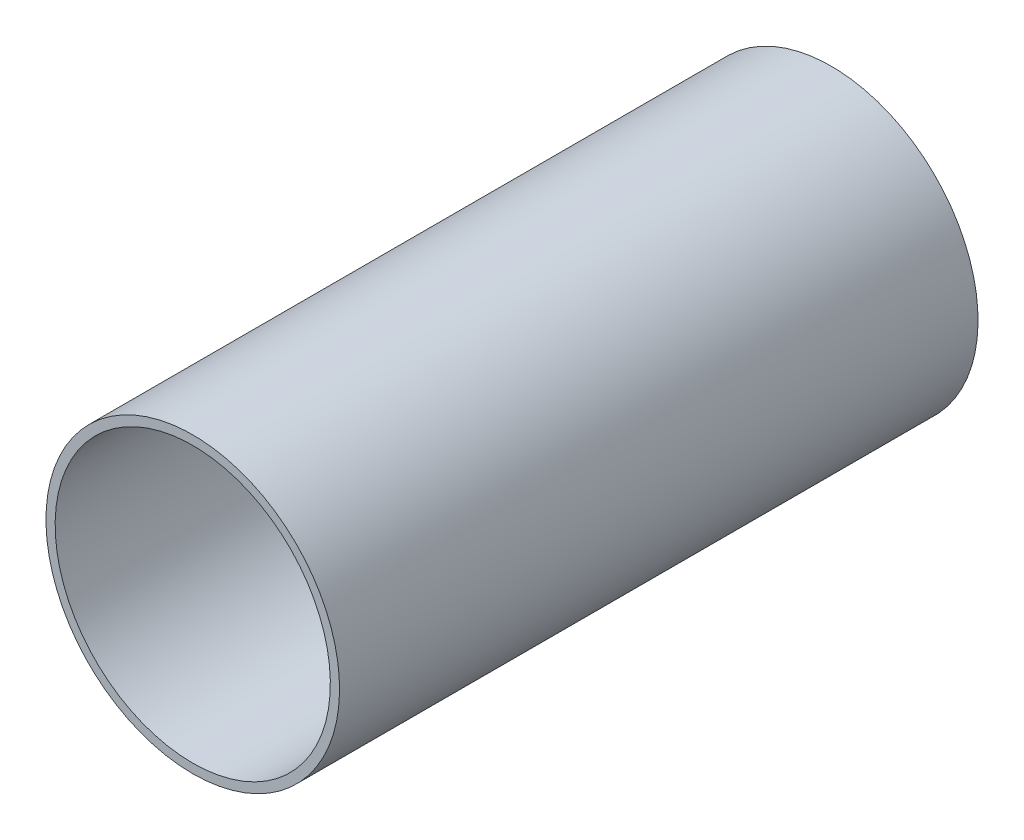
ISO-10303-21;
HEADER;
FILE_DESCRIPTION(('STEP AP214'),'2;1');
FILE_NAME('part.step','',(''),(''),'','','');
FILE_SCHEMA(('AUTOMOTIVE_DESIGN { 1 0 10303 214 1 1 1 1 }'));
ENDSEC;
DATA;
#1=APPLICATION_CONTEXT('core data for automotive mechanical design processes');
#2=APPLICATION_PROTOCOL_DEFINITION('international standard','automotive_design',2000,#1);
#3=PRODUCT_CONTEXT('',#1,'mechanical');
#4=PRODUCT('Part','Part','',(#3));
#5=PRODUCT_RELATED_PRODUCT_CATEGORY('part','',(#4));
#6=PRODUCT_DEFINITION_FORMATION('','',#4);
#7=PRODUCT_DEFINITION_CONTEXT('part definition',#1,'design');
#8=PRODUCT_DEFINITION('design','',#6,#7);
#9=PRODUCT_DEFINITION_SHAPE('','',#8);
#10=(LENGTH_UNIT() NAMED_UNIT(*) SI_UNIT(.MILLI.,.METRE.));
#11=(NAMED_UNIT(*) PLANE_ANGLE_UNIT() SI_UNIT($,.RADIAN.));
#12=(NAMED_UNIT(*) SI_UNIT($,.STERADIAN.) SOLID_ANGLE_UNIT());
#13=UNCERTAINTY_MEASURE_WITH_UNIT(LENGTH_MEASURE(1.E-05),#10,'distance_accuracy_value','');
#14=(GEOMETRIC_REPRESENTATION_CONTEXT(3) GLOBAL_UNCERTAINTY_ASSIGNED_CONTEXT((#13)) GLOBAL_UNIT_ASSIGNED_CONTEXT((#10,
#11,#12)) REPRESENTATION_CONTEXT('',''));
#15=CARTESIAN_POINT('',(0.,0.,0.));
#16=DIRECTION('',(0.,0.,1.));
#17=DIRECTION('',(1.,0.,0.));
#18=AXIS2_PLACEMENT_3D('',#15,#16,#17);
#19=CARTESIAN_POINT('',(152.4,-103.632,-0.045));
#20=DIRECTION('',(0.,0.,-1.));
#21=DIRECTION('',(0.,-1.,0.));
#22=AXIS2_PLACEMENT_3D('',#19,#20,#21);
#23=CYLINDRICAL_SURFACE('',#22,0.375);
#24=CARTESIAN_POINT('',(152.4,-103.632,-0.035));
#25=DIRECTION('',(0.,0.,-1.));
#26=DIRECTION('',(0.,-1.,0.));
#27=AXIS2_PLACEMENT_3D('',#24,#25,#26);
#28=CIRCLE('',#27,0.375);
#29=CARTESIAN_POINT('',(152.4,-104.007,-0.035));
#30=VERTEX_POINT('',#29);
#31=EDGE_CURVE('E65',#30,#30,#28,.T.);
#32=ORIENTED_EDGE('',*,*,#31,.T.);
#33=DIRECTION('',(0.,0.,1.));
#34=VECTOR('',#33,1.);
#35=CARTESIAN_POINT('',(152.4,-104.007,-0.045));
#36=LINE('',#35,#34);
#37=CARTESIAN_POINT('',(152.4,-104.007,1.705));
#38=VERTEX_POINT('',#37);
#39=EDGE_CURVE('E11',#30,#38,#36,.T.);
#40=ORIENTED_EDGE('',*,*,#39,.T.);
#41=CARTESIAN_POINT('',(152.4,-103.632,1.705));
#42=DIRECTION('',(0.,0.,-1.));
#43=DIRECTION('',(0.,-1.,0.));
#44=AXIS2_PLACEMENT_3D('',#41,#42,#43);
#45=CIRCLE('',#44,0.375);
#46=EDGE_CURVE('E27',#38,#38,#45,.T.);
#47=ORIENTED_EDGE('',*,*,#46,.F.);
#48=ORIENTED_EDGE('',*,*,#39,.F.);
#49=EDGE_LOOP('',(#32,#40,#47,#48));
#50=FACE_BOUND('',#49,.T.);
#51=ADVANCED_FACE('F17',(#50),#23,.F.);
#52=CARTESIAN_POINT('',(152.4,-104.032,1.705));
#53=DIRECTION('',(0.,0.,1.));
#54=DIRECTION('',(1.,0.,0.));
#55=AXIS2_PLACEMENT_3D('',#52,#53,#54);
#56=PLANE('',#55);
#57=ORIENTED_EDGE('',*,*,#46,.T.);
#58=EDGE_LOOP('',(#57));
#59=FACE_BOUND('',#58,.T.);
#60=CARTESIAN_POINT('',(152.4,-103.632,1.705));
#61=DIRECTION('',(0.,0.,1.));
#62=DIRECTION('',(0.,-1.,0.));
#63=AXIS2_PLACEMENT_3D('',#60,#61,#62);
#64=CIRCLE('',#63,0.4);
#65=CARTESIAN_POINT('',(152.4,-104.032,1.705));
#66=VERTEX_POINT('',#65);
#67=EDGE_CURVE('E47',#66,#66,#64,.T.);
#68=ORIENTED_EDGE('',*,*,#67,.T.);
#69=EDGE_LOOP('',(#68));
#70=FACE_BOUND('',#69,.T.);
#71=ADVANCED_FACE('F19',(#59,#70),#56,.T.);
#72=CARTESIAN_POINT('',(152.4,-104.032,-0.035));
#73=DIRECTION('',(0.,0.,1.));
#74=DIRECTION('',(1.,0.,0.));
#75=AXIS2_PLACEMENT_3D('',#72,#73,#74);
#76=PLANE('',#75);
#77=ORIENTED_EDGE('',*,*,#31,.F.);
#78=EDGE_LOOP('',(#77));
#79=FACE_BOUND('',#78,.T.);
#80=CARTESIAN_POINT('',(152.4,-103.632,-0.035));
#81=DIRECTION('',(0.,0.,1.));
#82=DIRECTION('',(0.,-1.,0.));
#83=AXIS2_PLACEMENT_3D('',#80,#81,#82);
#84=CIRCLE('',#83,0.4);
#85=CARTESIAN_POINT('',(152.4,-104.032,-0.035));
#86=VERTEX_POINT('',#85);
#87=EDGE_CURVE('E57',#86,#86,#84,.T.);
#88=ORIENTED_EDGE('',*,*,#87,.F.);
#89=EDGE_LOOP('',(#88));
#90=FACE_BOUND('',#89,.T.);
#91=ADVANCED_FACE('F76',(#79,#90),#76,.F.);
#92=CARTESIAN_POINT('',(152.4,-103.632,-0.035));
#93=DIRECTION('',(0.,0.,-1.));
#94=DIRECTION('',(0.,-1.,0.));
#95=AXIS2_PLACEMENT_3D('',#92,#93,#94);
#96=CYLINDRICAL_SURFACE('',#95,0.4);
#97=ORIENTED_EDGE('',*,*,#87,.T.);
#98=DIRECTION('',(0.,0.,1.));
#99=VECTOR('',#98,1.);
#100=CARTESIAN_POINT('',(152.4,-104.032,-0.035));
#101=LINE('',#100,#99);
#102=EDGE_CURVE('E54',#86,#66,#101,.T.);
#103=ORIENTED_EDGE('',*,*,#102,.T.);
#104=ORIENTED_EDGE('',*,*,#67,.F.);
#105=ORIENTED_EDGE('',*,*,#102,.F.);
#106=EDGE_LOOP('',(#97,#103,#104,#105));
#107=FACE_BOUND('',#106,.T.);
#108=ADVANCED_FACE('F55',(#107),#96,.T.);
#109=CLOSED_SHELL('',(#51,#71,#91,#108));
#110=MANIFOLD_SOLID_BREP('B1',#109);
#111=ADVANCED_BREP_SHAPE_REPRESENTATION('',(#18,#110),#14);
#112=SHAPE_DEFINITION_REPRESENTATION(#9,#111);
ENDSEC;
END-ISO-10303-21;
